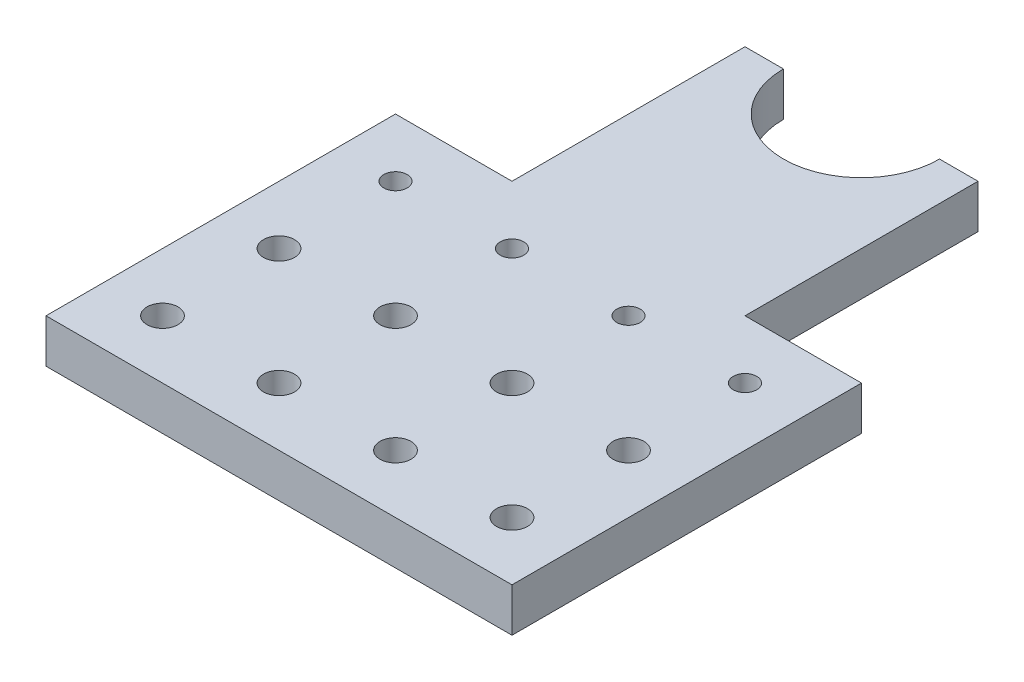
ISO-10303-21;
HEADER;
FILE_DESCRIPTION(('STEP AP214'),'2;1');
FILE_NAME('part.step','',(''),(''),'','','');
FILE_SCHEMA(('AUTOMOTIVE_DESIGN { 1 0 10303 214 1 1 1 1 }'));
ENDSEC;
DATA;
#1=APPLICATION_CONTEXT('core data for automotive mechanical design processes');
#2=APPLICATION_PROTOCOL_DEFINITION('international standard','automotive_design',2000,#1);
#3=PRODUCT_CONTEXT('',#1,'mechanical');
#4=PRODUCT('Part','Part','',(#3));
#5=PRODUCT_RELATED_PRODUCT_CATEGORY('part','',(#4));
#6=PRODUCT_DEFINITION_FORMATION('','',#4);
#7=PRODUCT_DEFINITION_CONTEXT('part definition',#1,'design');
#8=PRODUCT_DEFINITION('design','',#6,#7);
#9=PRODUCT_DEFINITION_SHAPE('','',#8);
#10=(LENGTH_UNIT() NAMED_UNIT(*) SI_UNIT(.MILLI.,.METRE.));
#11=(NAMED_UNIT(*) PLANE_ANGLE_UNIT() SI_UNIT($,.RADIAN.));
#12=(NAMED_UNIT(*) SI_UNIT($,.STERADIAN.) SOLID_ANGLE_UNIT());
#13=UNCERTAINTY_MEASURE_WITH_UNIT(LENGTH_MEASURE(1.E-05),#10,'distance_accuracy_value','');
#14=(GEOMETRIC_REPRESENTATION_CONTEXT(3) GLOBAL_UNCERTAINTY_ASSIGNED_CONTEXT((#13)) GLOBAL_UNIT_ASSIGNED_CONTEXT((#10,
#11,#12)) REPRESENTATION_CONTEXT('',''));
#15=CARTESIAN_POINT('',(0.,0.,0.));
#16=DIRECTION('',(0.,0.,1.));
#17=DIRECTION('',(1.,0.,0.));
#18=AXIS2_PLACEMENT_3D('',#15,#16,#17);
#19=CARTESIAN_POINT('',(0.,9.525,-127.));
#20=DIRECTION('',(0.,0.,1.));
#21=DIRECTION('',(1.,0.,0.));
#22=AXIS2_PLACEMENT_3D('',#19,#20,#21);
#23=PLANE('',#22);
#24=CARTESIAN_POINT('',(71.9455,4.7625,-127.));
#25=DIRECTION('',(0.,0.,-1.));
#26=DIRECTION('',(-1.,0.,0.));
#27=AXIS2_PLACEMENT_3D('',#24,#25,#26);
#28=CIRCLE('',#27,1.7272);
#29=CARTESIAN_POINT('',(70.2183,4.7625,-127.));
#30=VERTEX_POINT('',#29);
#31=EDGE_CURVE('E137',#30,#30,#28,.T.);
#32=ORIENTED_EDGE('',*,*,#31,.F.);
#33=EDGE_LOOP('',(#32));
#34=FACE_BOUND('',#33,.T.);
#35=DIRECTION('',(-1.,0.,0.));
#36=VECTOR('',#35,1.);
#37=CARTESIAN_POINT('',(0.,9.525,-127.));
#38=LINE('',#37,#36);
#39=CARTESIAN_POINT('',(76.2,9.525,-127.));
#40=VERTEX_POINT('',#39);
#41=CARTESIAN_POINT('',(67.818,9.525,-127.));
#42=VERTEX_POINT('',#41);
#43=EDGE_CURVE('E222',#40,#42,#38,.T.);
#44=ORIENTED_EDGE('',*,*,#43,.F.);
#45=DIRECTION('',(0.,1.,0.));
#46=VECTOR('',#45,1.);
#47=CARTESIAN_POINT('',(76.2,0.,-127.));
#48=LINE('',#47,#46);
#49=CARTESIAN_POINT('',(76.2,0.,-127.));
#50=VERTEX_POINT('',#49);
#51=EDGE_CURVE('E153',#50,#40,#48,.T.);
#52=ORIENTED_EDGE('',*,*,#51,.F.);
#53=DIRECTION('',(-1.,0.,0.));
#54=VECTOR('',#53,1.);
#55=CARTESIAN_POINT('',(0.,0.,-127.));
#56=LINE('',#55,#54);
#57=CARTESIAN_POINT('',(67.818,0.,-127.));
#58=VERTEX_POINT('',#57);
#59=EDGE_CURVE('E216',#50,#58,#56,.T.);
#60=ORIENTED_EDGE('',*,*,#59,.T.);
#61=DIRECTION('',(0.,1.,0.));
#62=VECTOR('',#61,1.);
#63=CARTESIAN_POINT('',(67.818,0.,-127.));
#64=LINE('',#63,#62);
#65=EDGE_CURVE('E209',#58,#42,#64,.T.);
#66=ORIENTED_EDGE('',*,*,#65,.T.);
#67=EDGE_LOOP('',(#44,#52,#60,#66));
#68=FACE_BOUND('',#67,.T.);
#69=ADVANCED_FACE('F45',(#34,#68),#23,.F.);
#70=CARTESIAN_POINT('',(0.,9.525,0.));
#71=DIRECTION('',(1.,0.,0.));
#72=DIRECTION('',(0.,0.,-1.));
#73=AXIS2_PLACEMENT_3D('',#70,#71,#72);
#74=PLANE('',#73);
#75=DIRECTION('',(0.,0.,1.));
#76=VECTOR('',#75,1.);
#77=CARTESIAN_POINT('',(0.,9.525,0.));
#78=LINE('',#77,#76);
#79=CARTESIAN_POINT('',(0.,9.525,-76.2));
#80=VERTEX_POINT('',#79);
#81=CARTESIAN_POINT('',(0.,9.525,0.));
#82=VERTEX_POINT('',#81);
#83=EDGE_CURVE('E213',#80,#82,#78,.T.);
#84=ORIENTED_EDGE('',*,*,#83,.F.);
#85=DIRECTION('',(0.,1.,0.));
#86=VECTOR('',#85,1.);
#87=CARTESIAN_POINT('',(0.,0.,-76.2));
#88=LINE('',#87,#86);
#89=CARTESIAN_POINT('',(0.,0.,-76.2));
#90=VERTEX_POINT('',#89);
#91=EDGE_CURVE('E169',#90,#80,#88,.T.);
#92=ORIENTED_EDGE('',*,*,#91,.F.);
#93=DIRECTION('',(0.,0.,1.));
#94=VECTOR('',#93,1.);
#95=CARTESIAN_POINT('',(0.,0.,0.));
#96=LINE('',#95,#94);
#97=CARTESIAN_POINT('',(0.,0.,0.));
#98=VERTEX_POINT('',#97);
#99=EDGE_CURVE('E212',#90,#98,#96,.T.);
#100=ORIENTED_EDGE('',*,*,#99,.T.);
#101=DIRECTION('',(0.,-1.,0.));
#102=VECTOR('',#101,1.);
#103=CARTESIAN_POINT('',(0.,9.525,0.));
#104=LINE('',#103,#102);
#105=EDGE_CURVE('E235',#82,#98,#104,.T.);
#106=ORIENTED_EDGE('',*,*,#105,.F.);
#107=EDGE_LOOP('',(#84,#92,#100,#106));
#108=FACE_BOUND('',#107,.T.);
#109=ADVANCED_FACE('F311',(#108),#74,.F.);
#110=CARTESIAN_POINT('',(0.,9.525,0.));
#111=DIRECTION('',(0.,0.,-1.));
#112=DIRECTION('',(-1.,0.,0.));
#113=AXIS2_PLACEMENT_3D('',#110,#111,#112);
#114=PLANE('',#113);
#115=DIRECTION('',(1.,0.,0.));
#116=VECTOR('',#115,1.);
#117=CARTESIAN_POINT('',(0.,0.,0.));
#118=LINE('',#117,#116);
#119=CARTESIAN_POINT('',(101.6,0.,0.));
#120=VERTEX_POINT('',#119);
#121=EDGE_CURVE('E226',#98,#120,#118,.T.);
#122=ORIENTED_EDGE('',*,*,#121,.T.);
#123=DIRECTION('',(0.,-1.,0.));
#124=VECTOR('',#123,1.);
#125=CARTESIAN_POINT('',(101.6,9.525,0.));
#126=LINE('',#125,#124);
#127=CARTESIAN_POINT('',(101.6,9.525,0.));
#128=VERTEX_POINT('',#127);
#129=EDGE_CURVE('E224',#128,#120,#126,.T.);
#130=ORIENTED_EDGE('',*,*,#129,.F.);
#131=DIRECTION('',(1.,0.,0.));
#132=VECTOR('',#131,1.);
#133=CARTESIAN_POINT('',(0.,9.525,0.));
#134=LINE('',#133,#132);
#135=EDGE_CURVE('E215',#82,#128,#134,.T.);
#136=ORIENTED_EDGE('',*,*,#135,.F.);
#137=ORIENTED_EDGE('',*,*,#105,.T.);
#138=EDGE_LOOP('',(#122,#130,#136,#137));
#139=FACE_BOUND('',#138,.T.);
#140=ADVANCED_FACE('F316',(#139),#114,.F.);
#141=CARTESIAN_POINT('',(101.6,9.525,0.));
#142=DIRECTION('',(-1.,0.,0.));
#143=DIRECTION('',(0.,0.,1.));
#144=AXIS2_PLACEMENT_3D('',#141,#142,#143);
#145=PLANE('',#144);
#146=DIRECTION('',(0.,0.,-1.));
#147=VECTOR('',#146,1.);
#148=CARTESIAN_POINT('',(101.6,0.,0.));
#149=LINE('',#148,#147);
#150=CARTESIAN_POINT('',(101.6,0.,-76.2));
#151=VERTEX_POINT('',#150);
#152=EDGE_CURVE('E228',#120,#151,#149,.T.);
#153=ORIENTED_EDGE('',*,*,#152,.T.);
#154=DIRECTION('',(0.,1.,0.));
#155=VECTOR('',#154,1.);
#156=CARTESIAN_POINT('',(101.6,0.,-76.2));
#157=LINE('',#156,#155);
#158=CARTESIAN_POINT('',(101.6,9.525,-76.2));
#159=VERTEX_POINT('',#158);
#160=EDGE_CURVE('E157',#151,#159,#157,.T.);
#161=ORIENTED_EDGE('',*,*,#160,.T.);
#162=DIRECTION('',(0.,0.,-1.));
#163=VECTOR('',#162,1.);
#164=CARTESIAN_POINT('',(101.6,9.525,0.));
#165=LINE('',#164,#163);
#166=EDGE_CURVE('E218',#128,#159,#165,.T.);
#167=ORIENTED_EDGE('',*,*,#166,.F.);
#168=ORIENTED_EDGE('',*,*,#129,.T.);
#169=EDGE_LOOP('',(#153,#161,#167,#168));
#170=FACE_BOUND('',#169,.T.);
#171=ADVANCED_FACE('F304',(#170),#145,.F.);
#172=CARTESIAN_POINT('',(29.6545,4.7625,-127.));
#173=DIRECTION('',(0.,0.,-1.));
#174=DIRECTION('',(-1.,0.,0.));
#175=AXIS2_PLACEMENT_3D('',#172,#173,#174);
#176=CIRCLE('',#175,1.7272);
#177=CARTESIAN_POINT('',(27.9273,4.7625,-127.));
#178=VERTEX_POINT('',#177);
#179=EDGE_CURVE('E136',#178,#178,#176,.T.);
#180=ORIENTED_EDGE('',*,*,#179,.F.);
#181=EDGE_LOOP('',(#180));
#182=FACE_BOUND('',#181,.T.);
#183=CARTESIAN_POINT('',(33.782,0.,-127.));
#184=VERTEX_POINT('',#183);
#185=CARTESIAN_POINT('',(25.4,0.,-127.));
#186=VERTEX_POINT('',#185);
#187=EDGE_CURVE('E231',#184,#186,#56,.T.);
#188=ORIENTED_EDGE('',*,*,#187,.T.);
#189=DIRECTION('',(0.,1.,0.));
#190=VECTOR('',#189,1.);
#191=CARTESIAN_POINT('',(25.4,0.,-127.));
#192=LINE('',#191,#190);
#193=CARTESIAN_POINT('',(25.4,9.525,-127.));
#194=VERTEX_POINT('',#193);
#195=EDGE_CURVE('E173',#186,#194,#192,.T.);
#196=ORIENTED_EDGE('',*,*,#195,.T.);
#197=CARTESIAN_POINT('',(33.782,9.525,-127.));
#198=VERTEX_POINT('',#197);
#199=EDGE_CURVE('E221',#198,#194,#38,.T.);
#200=ORIENTED_EDGE('',*,*,#199,.F.);
#201=DIRECTION('',(0.,1.,0.));
#202=VECTOR('',#201,1.);
#203=CARTESIAN_POINT('',(33.782,0.,-127.));
#204=LINE('',#203,#202);
#205=EDGE_CURVE('E206',#198,#184,#204,.F.);
#206=ORIENTED_EDGE('',*,*,#205,.T.);
#207=EDGE_LOOP('',(#188,#196,#200,#206));
#208=FACE_BOUND('',#207,.T.);
#209=ADVANCED_FACE('F294',(#182,#208),#23,.F.);
#210=CARTESIAN_POINT('',(0.,9.525,-127.));
#211=DIRECTION('',(0.,-1.,0.));
#212=DIRECTION('',(0.,0.,-1.));
#213=AXIS2_PLACEMENT_3D('',#210,#211,#212);
#214=PLANE('',#213);
#215=CARTESIAN_POINT('',(38.1,9.525,-63.5));
#216=DIRECTION('',(0.,1.,0.));
#217=DIRECTION('',(0.,0.,1.));
#218=AXIS2_PLACEMENT_3D('',#215,#216,#217);
#219=CIRCLE('',#218,2.55269999999999);
#220=CARTESIAN_POINT('',(38.1,9.525,-60.9473));
#221=VERTEX_POINT('',#220);
#222=EDGE_CURVE('E182',#221,#221,#219,.T.);
#223=ORIENTED_EDGE('',*,*,#222,.F.);
#224=EDGE_LOOP('',(#223));
#225=FACE_BOUND('',#224,.T.);
#226=CARTESIAN_POINT('',(12.7,9.525,-63.5));
#227=DIRECTION('',(0.,1.,0.));
#228=DIRECTION('',(0.,0.,1.));
#229=AXIS2_PLACEMENT_3D('',#226,#227,#228);
#230=CIRCLE('',#229,2.55269999999999);
#231=CARTESIAN_POINT('',(12.7,9.525,-60.9473));
#232=VERTEX_POINT('',#231);
#233=EDGE_CURVE('E185',#232,#232,#230,.T.);
#234=ORIENTED_EDGE('',*,*,#233,.F.);
#235=EDGE_LOOP('',(#234));
#236=FACE_BOUND('',#235,.T.);
#237=CARTESIAN_POINT('',(12.7,9.525,-38.1));
#238=DIRECTION('',(0.,1.,0.));
#239=DIRECTION('',(0.,0.,1.));
#240=AXIS2_PLACEMENT_3D('',#237,#238,#239);
#241=CIRCLE('',#240,3.37819999999999);
#242=CARTESIAN_POINT('',(12.7,9.525,-34.7218));
#243=VERTEX_POINT('',#242);
#244=EDGE_CURVE('E194',#243,#243,#241,.T.);
#245=ORIENTED_EDGE('',*,*,#244,.F.);
#246=EDGE_LOOP('',(#245));
#247=FACE_BOUND('',#246,.T.);
#248=CARTESIAN_POINT('',(12.7,9.525,-12.7));
#249=DIRECTION('',(0.,1.,0.));
#250=DIRECTION('',(0.,0.,1.));
#251=AXIS2_PLACEMENT_3D('',#248,#249,#250);
#252=CIRCLE('',#251,3.37819999999999);
#253=CARTESIAN_POINT('',(12.7,9.525,-9.32180000000001));
#254=VERTEX_POINT('',#253);
#255=EDGE_CURVE('E197',#254,#254,#252,.T.);
#256=ORIENTED_EDGE('',*,*,#255,.F.);
#257=EDGE_LOOP('',(#256));
#258=FACE_BOUND('',#257,.T.);
#259=ORIENTED_EDGE('',*,*,#166,.T.);
#260=DIRECTION('',(1.,0.,0.));
#261=VECTOR('',#260,1.);
#262=CARTESIAN_POINT('',(101.6,9.525,-76.2));
#263=LINE('',#262,#261);
#264=CARTESIAN_POINT('',(76.2,9.525,-76.2));
#265=VERTEX_POINT('',#264);
#266=EDGE_CURVE('E151',#265,#159,#263,.T.);
#267=ORIENTED_EDGE('',*,*,#266,.F.);
#268=DIRECTION('',(0.,0.,1.));
#269=VECTOR('',#268,1.);
#270=CARTESIAN_POINT('',(76.2,9.525,-127.));
#271=LINE('',#270,#269);
#272=EDGE_CURVE('E147',#40,#265,#271,.T.);
#273=ORIENTED_EDGE('',*,*,#272,.F.);
#274=ORIENTED_EDGE('',*,*,#43,.T.);
#275=CARTESIAN_POINT('',(50.8,9.525,-127.));
#276=DIRECTION('',(0.,1.,0.));
#277=DIRECTION('',(0.,0.,1.));
#278=AXIS2_PLACEMENT_3D('',#275,#276,#277);
#279=CIRCLE('',#278,17.018);
#280=EDGE_CURVE('E203',#198,#42,#279,.T.);
#281=ORIENTED_EDGE('',*,*,#280,.F.);
#282=ORIENTED_EDGE('',*,*,#199,.T.);
#283=DIRECTION('',(0.,0.,-1.));
#284=VECTOR('',#283,1.);
#285=CARTESIAN_POINT('',(25.4,9.525,-127.));
#286=LINE('',#285,#284);
#287=CARTESIAN_POINT('',(25.4,9.525,-76.2));
#288=VERTEX_POINT('',#287);
#289=EDGE_CURVE('E167',#288,#194,#286,.T.);
#290=ORIENTED_EDGE('',*,*,#289,.F.);
#291=DIRECTION('',(1.,0.,0.));
#292=VECTOR('',#291,1.);
#293=CARTESIAN_POINT('',(0.,9.525,-76.2));
#294=LINE('',#293,#292);
#295=EDGE_CURVE('E160',#80,#288,#294,.T.);
#296=ORIENTED_EDGE('',*,*,#295,.F.);
#297=ORIENTED_EDGE('',*,*,#83,.T.);
#298=ORIENTED_EDGE('',*,*,#135,.T.);
#299=EDGE_LOOP('',(#259,#267,#273,#274,#281,#282,#290,#296,#297,#298));
#300=FACE_BOUND('',#299,.T.);
#301=CARTESIAN_POINT('',(38.1,9.525,-12.7));
#302=DIRECTION('',(0.,1.,0.));
#303=DIRECTION('',(0.,0.,1.));
#304=AXIS2_PLACEMENT_3D('',#301,#302,#303);
#305=CIRCLE('',#304,3.37819999999999);
#306=CARTESIAN_POINT('',(38.1,9.525,-9.32180000000001));
#307=VERTEX_POINT('',#306);
#308=EDGE_CURVE('E243',#307,#307,#305,.T.);
#309=ORIENTED_EDGE('',*,*,#308,.F.);
#310=EDGE_LOOP('',(#309));
#311=FACE_BOUND('',#310,.T.);
#312=CARTESIAN_POINT('',(38.1,9.525,-38.1));
#313=DIRECTION('',(0.,1.,0.));
#314=DIRECTION('',(0.,0.,1.));
#315=AXIS2_PLACEMENT_3D('',#312,#313,#314);
#316=CIRCLE('',#315,3.37819999999999);
#317=CARTESIAN_POINT('',(38.1,9.525,-34.7218));
#318=VERTEX_POINT('',#317);
#319=EDGE_CURVE('E249',#318,#318,#316,.T.);
#320=ORIENTED_EDGE('',*,*,#319,.F.);
#321=EDGE_LOOP('',(#320));
#322=FACE_BOUND('',#321,.T.);
#323=CARTESIAN_POINT('',(63.5,9.525,-12.7));
#324=DIRECTION('',(0.,1.,0.));
#325=DIRECTION('',(0.,0.,1.));
#326=AXIS2_PLACEMENT_3D('',#323,#324,#325);
#327=CIRCLE('',#326,3.37819999999999);
#328=CARTESIAN_POINT('',(63.5,9.525,-9.32180000000001));
#329=VERTEX_POINT('',#328);
#330=EDGE_CURVE('E255',#329,#329,#327,.T.);
#331=ORIENTED_EDGE('',*,*,#330,.F.);
#332=EDGE_LOOP('',(#331));
#333=FACE_BOUND('',#332,.T.);
#334=CARTESIAN_POINT('',(63.5,9.525,-38.1));
#335=DIRECTION('',(0.,1.,0.));
#336=DIRECTION('',(0.,0.,1.));
#337=AXIS2_PLACEMENT_3D('',#334,#335,#336);
#338=CIRCLE('',#337,3.37819999999999);
#339=CARTESIAN_POINT('',(63.5,9.525,-34.7218));
#340=VERTEX_POINT('',#339);
#341=EDGE_CURVE('E261',#340,#340,#338,.T.);
#342=ORIENTED_EDGE('',*,*,#341,.F.);
#343=EDGE_LOOP('',(#342));
#344=FACE_BOUND('',#343,.T.);
#345=CARTESIAN_POINT('',(88.9,9.525,-12.7));
#346=DIRECTION('',(0.,1.,0.));
#347=DIRECTION('',(0.,0.,1.));
#348=AXIS2_PLACEMENT_3D('',#345,#346,#347);
#349=CIRCLE('',#348,3.37819999999999);
#350=CARTESIAN_POINT('',(88.9,9.525,-9.32180000000001));
#351=VERTEX_POINT('',#350);
#352=EDGE_CURVE('E267',#351,#351,#349,.T.);
#353=ORIENTED_EDGE('',*,*,#352,.F.);
#354=EDGE_LOOP('',(#353));
#355=FACE_BOUND('',#354,.T.);
#356=CARTESIAN_POINT('',(88.9,9.525,-38.1));
#357=DIRECTION('',(0.,1.,0.));
#358=DIRECTION('',(0.,0.,1.));
#359=AXIS2_PLACEMENT_3D('',#356,#357,#358);
#360=CIRCLE('',#359,3.37819999999999);
#361=CARTESIAN_POINT('',(88.9,9.525,-34.7218));
#362=VERTEX_POINT('',#361);
#363=EDGE_CURVE('E273',#362,#362,#360,.T.);
#364=ORIENTED_EDGE('',*,*,#363,.F.);
#365=EDGE_LOOP('',(#364));
#366=FACE_BOUND('',#365,.T.);
#367=CARTESIAN_POINT('',(63.5,9.525,-63.5));
#368=DIRECTION('',(0.,1.,0.));
#369=DIRECTION('',(0.,0.,1.));
#370=AXIS2_PLACEMENT_3D('',#367,#368,#369);
#371=CIRCLE('',#370,2.55269999999999);
#372=CARTESIAN_POINT('',(63.5,9.525,-60.9473));
#373=VERTEX_POINT('',#372);
#374=EDGE_CURVE('E279',#373,#373,#371,.T.);
#375=ORIENTED_EDGE('',*,*,#374,.F.);
#376=EDGE_LOOP('',(#375));
#377=FACE_BOUND('',#376,.T.);
#378=CARTESIAN_POINT('',(88.9,9.525,-63.5));
#379=DIRECTION('',(0.,1.,0.));
#380=DIRECTION('',(0.,0.,1.));
#381=AXIS2_PLACEMENT_3D('',#378,#379,#380);
#382=CIRCLE('',#381,2.55269999999999);
#383=CARTESIAN_POINT('',(88.9,9.525,-60.9473));
#384=VERTEX_POINT('',#383);
#385=EDGE_CURVE('E13',#384,#384,#382,.T.);
#386=ORIENTED_EDGE('',*,*,#385,.F.);
#387=EDGE_LOOP('',(#386));
#388=FACE_BOUND('',#387,.T.);
#389=ADVANCED_FACE('F292',(#225,#236,#247,#258,#300,#311,#322,#333,#344,#355,#366,#377,#388),
#214,.F.);
#390=CARTESIAN_POINT('',(0.,0.,-127.));
#391=DIRECTION('',(0.,-1.,0.));
#392=DIRECTION('',(0.,0.,-1.));
#393=AXIS2_PLACEMENT_3D('',#390,#391,#392);
#394=PLANE('',#393);
#395=DIRECTION('',(1.,0.,0.));
#396=VECTOR('',#395,1.);
#397=CARTESIAN_POINT('',(101.6,0.,-76.2));
#398=LINE('',#397,#396);
#399=CARTESIAN_POINT('',(76.2,0.,-76.2));
#400=VERTEX_POINT('',#399);
#401=EDGE_CURVE('E60',#400,#151,#398,.T.);
#402=ORIENTED_EDGE('',*,*,#401,.T.);
#403=ORIENTED_EDGE('',*,*,#152,.F.);
#404=ORIENTED_EDGE('',*,*,#121,.F.);
#405=ORIENTED_EDGE('',*,*,#99,.F.);
#406=DIRECTION('',(1.,0.,0.));
#407=VECTOR('',#406,1.);
#408=CARTESIAN_POINT('',(0.,0.,-76.2));
#409=LINE('',#408,#407);
#410=CARTESIAN_POINT('',(25.4,0.,-76.2));
#411=VERTEX_POINT('',#410);
#412=EDGE_CURVE('E164',#90,#411,#409,.T.);
#413=ORIENTED_EDGE('',*,*,#412,.T.);
#414=DIRECTION('',(0.,0.,-1.));
#415=VECTOR('',#414,1.);
#416=CARTESIAN_POINT('',(25.4,0.,-127.));
#417=LINE('',#416,#415);
#418=EDGE_CURVE('E68',#411,#186,#417,.T.);
#419=ORIENTED_EDGE('',*,*,#418,.T.);
#420=ORIENTED_EDGE('',*,*,#187,.F.);
#421=CARTESIAN_POINT('',(50.8,0.,-127.));
#422=DIRECTION('',(0.,-1.,0.));
#423=DIRECTION('',(0.,0.,-1.));
#424=AXIS2_PLACEMENT_3D('',#421,#422,#423);
#425=CIRCLE('',#424,17.018);
#426=EDGE_CURVE('E238',#58,#184,#425,.T.);
#427=ORIENTED_EDGE('',*,*,#426,.F.);
#428=ORIENTED_EDGE('',*,*,#59,.F.);
#429=DIRECTION('',(0.,0.,1.));
#430=VECTOR('',#429,1.);
#431=CARTESIAN_POINT('',(76.2,0.,-127.));
#432=LINE('',#431,#430);
#433=EDGE_CURVE('E148',#50,#400,#432,.T.);
#434=ORIENTED_EDGE('',*,*,#433,.T.);
#435=EDGE_LOOP('',(#402,#403,#404,#405,#413,#419,#420,#427,#428,#434));
#436=FACE_BOUND('',#435,.T.);
#437=CARTESIAN_POINT('',(38.1,0.,-63.5));
#438=DIRECTION('',(0.,1.,0.));
#439=DIRECTION('',(0.,0.,1.));
#440=AXIS2_PLACEMENT_3D('',#437,#438,#439);
#441=CIRCLE('',#440,2.5527);
#442=CARTESIAN_POINT('',(38.1,0.,-60.9473));
#443=VERTEX_POINT('',#442);
#444=EDGE_CURVE('E176',#443,#443,#441,.T.);
#445=ORIENTED_EDGE('',*,*,#444,.T.);
#446=EDGE_LOOP('',(#445));
#447=FACE_BOUND('',#446,.T.);
#448=CARTESIAN_POINT('',(12.7,0.,-63.5));
#449=DIRECTION('',(0.,1.,0.));
#450=DIRECTION('',(0.,0.,1.));
#451=AXIS2_PLACEMENT_3D('',#448,#449,#450);
#452=CIRCLE('',#451,2.5527);
#453=CARTESIAN_POINT('',(12.7,0.,-60.9473));
#454=VERTEX_POINT('',#453);
#455=EDGE_CURVE('E188',#454,#454,#452,.T.);
#456=ORIENTED_EDGE('',*,*,#455,.T.);
#457=EDGE_LOOP('',(#456));
#458=FACE_BOUND('',#457,.T.);
#459=CARTESIAN_POINT('',(12.7,0.,-38.1));
#460=DIRECTION('',(0.,1.,0.));
#461=DIRECTION('',(0.,0.,1.));
#462=AXIS2_PLACEMENT_3D('',#459,#460,#461);
#463=CIRCLE('',#462,3.3782);
#464=CARTESIAN_POINT('',(12.7,0.,-34.7218));
#465=VERTEX_POINT('',#464);
#466=EDGE_CURVE('E191',#465,#465,#463,.T.);
#467=ORIENTED_EDGE('',*,*,#466,.T.);
#468=EDGE_LOOP('',(#467));
#469=FACE_BOUND('',#468,.T.);
#470=CARTESIAN_POINT('',(12.7,0.,-12.7));
#471=DIRECTION('',(0.,1.,0.));
#472=DIRECTION('',(0.,0.,1.));
#473=AXIS2_PLACEMENT_3D('',#470,#471,#472);
#474=CIRCLE('',#473,3.3782);
#475=CARTESIAN_POINT('',(12.7,0.,-9.3218));
#476=VERTEX_POINT('',#475);
#477=EDGE_CURVE('E200',#476,#476,#474,.T.);
#478=ORIENTED_EDGE('',*,*,#477,.T.);
#479=EDGE_LOOP('',(#478));
#480=FACE_BOUND('',#479,.T.);
#481=CARTESIAN_POINT('',(38.1,0.,-12.7));
#482=DIRECTION('',(0.,1.,0.));
#483=DIRECTION('',(0.,0.,1.));
#484=AXIS2_PLACEMENT_3D('',#481,#482,#483);
#485=CIRCLE('',#484,3.3782);
#486=CARTESIAN_POINT('',(38.1,0.,-9.3218));
#487=VERTEX_POINT('',#486);
#488=EDGE_CURVE('E240',#487,#487,#485,.T.);
#489=ORIENTED_EDGE('',*,*,#488,.T.);
#490=EDGE_LOOP('',(#489));
#491=FACE_BOUND('',#490,.T.);
#492=CARTESIAN_POINT('',(38.1,0.,-38.1));
#493=DIRECTION('',(0.,1.,0.));
#494=DIRECTION('',(0.,0.,1.));
#495=AXIS2_PLACEMENT_3D('',#492,#493,#494);
#496=CIRCLE('',#495,3.3782);
#497=CARTESIAN_POINT('',(38.1,0.,-34.7218));
#498=VERTEX_POINT('',#497);
#499=EDGE_CURVE('E246',#498,#498,#496,.T.);
#500=ORIENTED_EDGE('',*,*,#499,.T.);
#501=EDGE_LOOP('',(#500));
#502=FACE_BOUND('',#501,.T.);
#503=CARTESIAN_POINT('',(63.5,0.,-12.7));
#504=DIRECTION('',(0.,1.,0.));
#505=DIRECTION('',(0.,0.,1.));
#506=AXIS2_PLACEMENT_3D('',#503,#504,#505);
#507=CIRCLE('',#506,3.3782);
#508=CARTESIAN_POINT('',(63.5,0.,-9.3218));
#509=VERTEX_POINT('',#508);
#510=EDGE_CURVE('E252',#509,#509,#507,.T.);
#511=ORIENTED_EDGE('',*,*,#510,.T.);
#512=EDGE_LOOP('',(#511));
#513=FACE_BOUND('',#512,.T.);
#514=CARTESIAN_POINT('',(63.5,0.,-38.1));
#515=DIRECTION('',(0.,1.,0.));
#516=DIRECTION('',(0.,0.,1.));
#517=AXIS2_PLACEMENT_3D('',#514,#515,#516);
#518=CIRCLE('',#517,3.3782);
#519=CARTESIAN_POINT('',(63.5,0.,-34.7218));
#520=VERTEX_POINT('',#519);
#521=EDGE_CURVE('E258',#520,#520,#518,.T.);
#522=ORIENTED_EDGE('',*,*,#521,.T.);
#523=EDGE_LOOP('',(#522));
#524=FACE_BOUND('',#523,.T.);
#525=CARTESIAN_POINT('',(88.9,0.,-12.7));
#526=DIRECTION('',(0.,1.,0.));
#527=DIRECTION('',(0.,0.,1.));
#528=AXIS2_PLACEMENT_3D('',#525,#526,#527);
#529=CIRCLE('',#528,3.3782);
#530=CARTESIAN_POINT('',(88.9,0.,-9.3218));
#531=VERTEX_POINT('',#530);
#532=EDGE_CURVE('E264',#531,#531,#529,.T.);
#533=ORIENTED_EDGE('',*,*,#532,.T.);
#534=EDGE_LOOP('',(#533));
#535=FACE_BOUND('',#534,.T.);
#536=CARTESIAN_POINT('',(88.9,0.,-38.1));
#537=DIRECTION('',(0.,1.,0.));
#538=DIRECTION('',(0.,0.,1.));
#539=AXIS2_PLACEMENT_3D('',#536,#537,#538);
#540=CIRCLE('',#539,3.3782);
#541=CARTESIAN_POINT('',(88.9,0.,-34.7218));
#542=VERTEX_POINT('',#541);
#543=EDGE_CURVE('E270',#542,#542,#540,.T.);
#544=ORIENTED_EDGE('',*,*,#543,.T.);
#545=EDGE_LOOP('',(#544));
#546=FACE_BOUND('',#545,.T.);
#547=CARTESIAN_POINT('',(63.5,0.,-63.5));
#548=DIRECTION('',(0.,1.,0.));
#549=DIRECTION('',(0.,0.,1.));
#550=AXIS2_PLACEMENT_3D('',#547,#548,#549);
#551=CIRCLE('',#550,2.5527);
#552=CARTESIAN_POINT('',(63.5,0.,-60.9473));
#553=VERTEX_POINT('',#552);
#554=EDGE_CURVE('E276',#553,#553,#551,.T.);
#555=ORIENTED_EDGE('',*,*,#554,.T.);
#556=EDGE_LOOP('',(#555));
#557=FACE_BOUND('',#556,.T.);
#558=CARTESIAN_POINT('',(88.9,0.,-63.5));
#559=DIRECTION('',(0.,1.,0.));
#560=DIRECTION('',(0.,0.,1.));
#561=AXIS2_PLACEMENT_3D('',#558,#559,#560);
#562=CIRCLE('',#561,2.5527);
#563=CARTESIAN_POINT('',(88.9,0.,-60.9473));
#564=VERTEX_POINT('',#563);
#565=EDGE_CURVE('E53',#564,#564,#562,.T.);
#566=ORIENTED_EDGE('',*,*,#565,.T.);
#567=EDGE_LOOP('',(#566));
#568=FACE_BOUND('',#567,.T.);
#569=ADVANCED_FACE('F284',(#436,#447,#458,#469,#480,#491,#502,#513,#524,#535,#546,#557,#568),
#394,.T.);
#570=CARTESIAN_POINT('',(50.8,0.,-127.));
#571=DIRECTION('',(0.,1.,0.));
#572=DIRECTION('',(0.,0.,1.));
#573=AXIS2_PLACEMENT_3D('',#570,#571,#572);
#574=CYLINDRICAL_SURFACE('',#573,17.018);
#575=ORIENTED_EDGE('',*,*,#426,.T.);
#576=ORIENTED_EDGE('',*,*,#205,.F.);
#577=ORIENTED_EDGE('',*,*,#280,.T.);
#578=ORIENTED_EDGE('',*,*,#65,.F.);
#579=EDGE_LOOP('',(#575,#576,#577,#578));
#580=FACE_BOUND('',#579,.T.);
#581=ADVANCED_FACE('F301',(#580),#574,.F.);
#582=CARTESIAN_POINT('',(12.7,9.525,-12.7));
#583=DIRECTION('',(0.,1.,0.));
#584=DIRECTION('',(0.,0.,1.));
#585=AXIS2_PLACEMENT_3D('',#582,#583,#584);
#586=CYLINDRICAL_SURFACE('',#585,3.37819999999999);
#587=ORIENTED_EDGE('',*,*,#477,.F.);
#588=EDGE_LOOP('',(#587));
#589=FACE_BOUND('',#588,.T.);
#590=ORIENTED_EDGE('',*,*,#255,.T.);
#591=EDGE_LOOP('',(#590));
#592=FACE_BOUND('',#591,.T.);
#593=ADVANCED_FACE('F379',(#589,#592),#586,.F.);
#594=CARTESIAN_POINT('',(12.7,9.525,-38.1));
#595=DIRECTION('',(0.,1.,0.));
#596=DIRECTION('',(0.,0.,1.));
#597=AXIS2_PLACEMENT_3D('',#594,#595,#596);
#598=CYLINDRICAL_SURFACE('',#597,3.37819999999999);
#599=ORIENTED_EDGE('',*,*,#466,.F.);
#600=EDGE_LOOP('',(#599));
#601=FACE_BOUND('',#600,.T.);
#602=ORIENTED_EDGE('',*,*,#244,.T.);
#603=EDGE_LOOP('',(#602));
#604=FACE_BOUND('',#603,.T.);
#605=ADVANCED_FACE('F332',(#601,#604),#598,.F.);
#606=CARTESIAN_POINT('',(38.1,9.525,-12.7));
#607=DIRECTION('',(0.,1.,0.));
#608=DIRECTION('',(0.,0.,1.));
#609=AXIS2_PLACEMENT_3D('',#606,#607,#608);
#610=CYLINDRICAL_SURFACE('',#609,3.37819999999999);
#611=ORIENTED_EDGE('',*,*,#488,.F.);
#612=EDGE_LOOP('',(#611));
#613=FACE_BOUND('',#612,.T.);
#614=ORIENTED_EDGE('',*,*,#308,.T.);
#615=EDGE_LOOP('',(#614));
#616=FACE_BOUND('',#615,.T.);
#617=ADVANCED_FACE('F328',(#613,#616),#610,.F.);
#618=CARTESIAN_POINT('',(38.1,9.525,-38.1));
#619=DIRECTION('',(0.,1.,0.));
#620=DIRECTION('',(0.,0.,1.));
#621=AXIS2_PLACEMENT_3D('',#618,#619,#620);
#622=CYLINDRICAL_SURFACE('',#621,3.37819999999999);
#623=ORIENTED_EDGE('',*,*,#499,.F.);
#624=EDGE_LOOP('',(#623));
#625=FACE_BOUND('',#624,.T.);
#626=ORIENTED_EDGE('',*,*,#319,.T.);
#627=EDGE_LOOP('',(#626));
#628=FACE_BOUND('',#627,.T.);
#629=ADVANCED_FACE('F331',(#625,#628),#622,.F.);
#630=CARTESIAN_POINT('',(63.5,9.525,-12.7));
#631=DIRECTION('',(0.,1.,0.));
#632=DIRECTION('',(0.,0.,1.));
#633=AXIS2_PLACEMENT_3D('',#630,#631,#632);
#634=CYLINDRICAL_SURFACE('',#633,3.37819999999999);
#635=ORIENTED_EDGE('',*,*,#510,.F.);
#636=EDGE_LOOP('',(#635));
#637=FACE_BOUND('',#636,.T.);
#638=ORIENTED_EDGE('',*,*,#330,.T.);
#639=EDGE_LOOP('',(#638));
#640=FACE_BOUND('',#639,.T.);
#641=ADVANCED_FACE('F336',(#637,#640),#634,.F.);
#642=CARTESIAN_POINT('',(63.5,9.525,-38.1));
#643=DIRECTION('',(0.,1.,0.));
#644=DIRECTION('',(0.,0.,1.));
#645=AXIS2_PLACEMENT_3D('',#642,#643,#644);
#646=CYLINDRICAL_SURFACE('',#645,3.37819999999999);
#647=ORIENTED_EDGE('',*,*,#521,.F.);
#648=EDGE_LOOP('',(#647));
#649=FACE_BOUND('',#648,.T.);
#650=ORIENTED_EDGE('',*,*,#341,.T.);
#651=EDGE_LOOP('',(#650));
#652=FACE_BOUND('',#651,.T.);
#653=ADVANCED_FACE('F340',(#649,#652),#646,.F.);
#654=CARTESIAN_POINT('',(88.9,9.525,-12.7));
#655=DIRECTION('',(0.,1.,0.));
#656=DIRECTION('',(0.,0.,1.));
#657=AXIS2_PLACEMENT_3D('',#654,#655,#656);
#658=CYLINDRICAL_SURFACE('',#657,3.37819999999999);
#659=ORIENTED_EDGE('',*,*,#532,.F.);
#660=EDGE_LOOP('',(#659));
#661=FACE_BOUND('',#660,.T.);
#662=ORIENTED_EDGE('',*,*,#352,.T.);
#663=EDGE_LOOP('',(#662));
#664=FACE_BOUND('',#663,.T.);
#665=ADVANCED_FACE('F344',(#661,#664),#658,.F.);
#666=CARTESIAN_POINT('',(88.9,9.525,-38.1));
#667=DIRECTION('',(0.,1.,0.));
#668=DIRECTION('',(0.,0.,1.));
#669=AXIS2_PLACEMENT_3D('',#666,#667,#668);
#670=CYLINDRICAL_SURFACE('',#669,3.37819999999999);
#671=ORIENTED_EDGE('',*,*,#543,.F.);
#672=EDGE_LOOP('',(#671));
#673=FACE_BOUND('',#672,.T.);
#674=ORIENTED_EDGE('',*,*,#363,.T.);
#675=EDGE_LOOP('',(#674));
#676=FACE_BOUND('',#675,.T.);
#677=ADVANCED_FACE('F348',(#673,#676),#670,.F.);
#678=CARTESIAN_POINT('',(12.7,9.525,-63.5));
#679=DIRECTION('',(0.,1.,0.));
#680=DIRECTION('',(0.,0.,1.));
#681=AXIS2_PLACEMENT_3D('',#678,#679,#680);
#682=CYLINDRICAL_SURFACE('',#681,2.55269999999999);
#683=ORIENTED_EDGE('',*,*,#455,.F.);
#684=EDGE_LOOP('',(#683));
#685=FACE_BOUND('',#684,.T.);
#686=ORIENTED_EDGE('',*,*,#233,.T.);
#687=EDGE_LOOP('',(#686));
#688=FACE_BOUND('',#687,.T.);
#689=ADVANCED_FACE('F351',(#685,#688),#682,.F.);
#690=CARTESIAN_POINT('',(38.1,9.525,-63.5));
#691=DIRECTION('',(0.,1.,0.));
#692=DIRECTION('',(0.,0.,1.));
#693=AXIS2_PLACEMENT_3D('',#690,#691,#692);
#694=CYLINDRICAL_SURFACE('',#693,2.55269999999999);
#695=ORIENTED_EDGE('',*,*,#444,.F.);
#696=EDGE_LOOP('',(#695));
#697=FACE_BOUND('',#696,.T.);
#698=ORIENTED_EDGE('',*,*,#222,.T.);
#699=EDGE_LOOP('',(#698));
#700=FACE_BOUND('',#699,.T.);
#701=ADVANCED_FACE('F354',(#697,#700),#694,.F.);
#702=CARTESIAN_POINT('',(63.5,9.525,-63.5));
#703=DIRECTION('',(0.,1.,0.));
#704=DIRECTION('',(0.,0.,1.));
#705=AXIS2_PLACEMENT_3D('',#702,#703,#704);
#706=CYLINDRICAL_SURFACE('',#705,2.55269999999999);
#707=ORIENTED_EDGE('',*,*,#554,.F.);
#708=EDGE_LOOP('',(#707));
#709=FACE_BOUND('',#708,.T.);
#710=ORIENTED_EDGE('',*,*,#374,.T.);
#711=EDGE_LOOP('',(#710));
#712=FACE_BOUND('',#711,.T.);
#713=ADVANCED_FACE('F289',(#709,#712),#706,.F.);
#714=CARTESIAN_POINT('',(88.9,9.525,-63.5));
#715=DIRECTION('',(0.,1.,0.));
#716=DIRECTION('',(0.,0.,1.));
#717=AXIS2_PLACEMENT_3D('',#714,#715,#716);
#718=CYLINDRICAL_SURFACE('',#717,2.55269999999999);
#719=ORIENTED_EDGE('',*,*,#565,.F.);
#720=EDGE_LOOP('',(#719));
#721=FACE_BOUND('',#720,.T.);
#722=ORIENTED_EDGE('',*,*,#385,.T.);
#723=EDGE_LOOP('',(#722));
#724=FACE_BOUND('',#723,.T.);
#725=ADVANCED_FACE('F47',(#721,#724),#718,.F.);
#726=CARTESIAN_POINT('',(25.4,0.,-127.));
#727=DIRECTION('',(1.,0.,0.));
#728=DIRECTION('',(0.,0.,-1.));
#729=AXIS2_PLACEMENT_3D('',#726,#727,#728);
#730=PLANE('',#729);
#731=ORIENTED_EDGE('',*,*,#289,.T.);
#732=ORIENTED_EDGE('',*,*,#195,.F.);
#733=ORIENTED_EDGE('',*,*,#418,.F.);
#734=DIRECTION('',(0.,1.,0.));
#735=VECTOR('',#734,1.);
#736=CARTESIAN_POINT('',(25.4,0.,-76.2));
#737=LINE('',#736,#735);
#738=EDGE_CURVE('E177',#411,#288,#737,.T.);
#739=ORIENTED_EDGE('',*,*,#738,.T.);
#740=EDGE_LOOP('',(#731,#732,#733,#739));
#741=FACE_BOUND('',#740,.T.);
#742=ADVANCED_FACE('F288',(#741),#730,.F.);
#743=CARTESIAN_POINT('',(0.,0.,-76.2));
#744=DIRECTION('',(0.,0.,1.));
#745=DIRECTION('',(1.,0.,0.));
#746=AXIS2_PLACEMENT_3D('',#743,#744,#745);
#747=PLANE('',#746);
#748=ORIENTED_EDGE('',*,*,#295,.T.);
#749=ORIENTED_EDGE('',*,*,#738,.F.);
#750=ORIENTED_EDGE('',*,*,#412,.F.);
#751=ORIENTED_EDGE('',*,*,#91,.T.);
#752=EDGE_LOOP('',(#748,#749,#750,#751));
#753=FACE_BOUND('',#752,.T.);
#754=ADVANCED_FACE('F374',(#753),#747,.F.);
#755=CARTESIAN_POINT('',(101.6,0.,-76.2));
#756=DIRECTION('',(0.,0.,1.));
#757=DIRECTION('',(1.,0.,0.));
#758=AXIS2_PLACEMENT_3D('',#755,#756,#757);
#759=PLANE('',#758);
#760=ORIENTED_EDGE('',*,*,#266,.T.);
#761=ORIENTED_EDGE('',*,*,#160,.F.);
#762=ORIENTED_EDGE('',*,*,#401,.F.);
#763=DIRECTION('',(0.,1.,0.));
#764=VECTOR('',#763,1.);
#765=CARTESIAN_POINT('',(76.2,0.,-76.2));
#766=LINE('',#765,#764);
#767=EDGE_CURVE('E161',#400,#265,#766,.T.);
#768=ORIENTED_EDGE('',*,*,#767,.T.);
#769=EDGE_LOOP('',(#760,#761,#762,#768));
#770=FACE_BOUND('',#769,.T.);
#771=ADVANCED_FACE('F414',(#770),#759,.F.);
#772=CARTESIAN_POINT('',(76.2,0.,-127.));
#773=DIRECTION('',(-1.,0.,0.));
#774=DIRECTION('',(0.,0.,1.));
#775=AXIS2_PLACEMENT_3D('',#772,#773,#774);
#776=PLANE('',#775);
#777=ORIENTED_EDGE('',*,*,#272,.T.);
#778=ORIENTED_EDGE('',*,*,#767,.F.);
#779=ORIENTED_EDGE('',*,*,#433,.F.);
#780=ORIENTED_EDGE('',*,*,#51,.T.);
#781=EDGE_LOOP('',(#777,#778,#779,#780));
#782=FACE_BOUND('',#781,.T.);
#783=ADVANCED_FACE('F416',(#782),#776,.F.);
#784=CARTESIAN_POINT('',(29.6545,4.7625,-116.332));
#785=DIRECTION('',(0.,0.,-1.));
#786=DIRECTION('',(-1.,0.,0.));
#787=AXIS2_PLACEMENT_3D('',#784,#785,#786);
#788=CONICAL_SURFACE('',#787,1.7272,1.02974425867665);
#789=CARTESIAN_POINT('',(29.6545,4.7625,-115.294193538816));
#790=VERTEX_POINT('',#789);
#791=VERTEX_LOOP('',#790);
#792=FACE_BOUND('',#791,.T.);
#793=CARTESIAN_POINT('',(29.6545,4.7625,-116.332));
#794=DIRECTION('',(0.,0.,-1.));
#795=DIRECTION('',(-1.,0.,0.));
#796=AXIS2_PLACEMENT_3D('',#793,#794,#795);
#797=CIRCLE('',#796,1.7272);
#798=CARTESIAN_POINT('',(27.9273,4.7625,-116.332));
#799=VERTEX_POINT('',#798);
#800=EDGE_CURVE('E140',#799,#799,#797,.T.);
#801=ORIENTED_EDGE('',*,*,#800,.T.);
#802=EDGE_LOOP('',(#801));
#803=FACE_BOUND('',#802,.T.);
#804=ADVANCED_FACE('F425',(#792,#803),#788,.F.);
#805=CARTESIAN_POINT('',(29.6545,4.7625,-127.));
#806=DIRECTION('',(0.,0.,-1.));
#807=DIRECTION('',(-1.,0.,0.));
#808=AXIS2_PLACEMENT_3D('',#805,#806,#807);
#809=CYLINDRICAL_SURFACE('',#808,1.7272);
#810=ORIENTED_EDGE('',*,*,#800,.F.);
#811=EDGE_LOOP('',(#810));
#812=FACE_BOUND('',#811,.T.);
#813=ORIENTED_EDGE('',*,*,#179,.T.);
#814=EDGE_LOOP('',(#813));
#815=FACE_BOUND('',#814,.T.);
#816=ADVANCED_FACE('F130',(#812,#815),#809,.F.);
#817=CARTESIAN_POINT('',(71.9455,4.7625,-116.332));
#818=DIRECTION('',(0.,0.,-1.));
#819=DIRECTION('',(-1.,0.,0.));
#820=AXIS2_PLACEMENT_3D('',#817,#818,#819);
#821=CONICAL_SURFACE('',#820,1.7272,1.02974425867665);
#822=CARTESIAN_POINT('',(71.9455,4.7625,-115.294193538816));
#823=VERTEX_POINT('',#822);
#824=VERTEX_LOOP('',#823);
#825=FACE_BOUND('',#824,.T.);
#826=CARTESIAN_POINT('',(71.9455,4.7625,-116.332));
#827=DIRECTION('',(0.,0.,-1.));
#828=DIRECTION('',(-1.,0.,0.));
#829=AXIS2_PLACEMENT_3D('',#826,#827,#828);
#830=CIRCLE('',#829,1.7272);
#831=CARTESIAN_POINT('',(70.2183,4.7625,-116.332));
#832=VERTEX_POINT('',#831);
#833=EDGE_CURVE('E134',#832,#832,#830,.T.);
#834=ORIENTED_EDGE('',*,*,#833,.T.);
#835=EDGE_LOOP('',(#834));
#836=FACE_BOUND('',#835,.T.);
#837=ADVANCED_FACE('F126',(#825,#836),#821,.F.);
#838=CARTESIAN_POINT('',(71.9455,4.7625,-127.));
#839=DIRECTION('',(0.,0.,-1.));
#840=DIRECTION('',(-1.,0.,0.));
#841=AXIS2_PLACEMENT_3D('',#838,#839,#840);
#842=CYLINDRICAL_SURFACE('',#841,1.7272);
#843=ORIENTED_EDGE('',*,*,#833,.F.);
#844=EDGE_LOOP('',(#843));
#845=FACE_BOUND('',#844,.T.);
#846=ORIENTED_EDGE('',*,*,#31,.T.);
#847=EDGE_LOOP('',(#846));
#848=FACE_BOUND('',#847,.T.);
#849=ADVANCED_FACE('F129',(#845,#848),#842,.F.);
#850=CLOSED_SHELL('',(#69,#109,#140,#171,#209,#389,#569,#581,#593,#605,#617,#629,#641,#653,#665,
#677,#689,#701,#713,#725,#742,#754,#771,#783,#804,#816,#837,#849));
#851=MANIFOLD_SOLID_BREP('B2',#850);
#852=ADVANCED_BREP_SHAPE_REPRESENTATION('',(#18,#851),#14);
#853=SHAPE_DEFINITION_REPRESENTATION(#9,#852);
ENDSEC;
END-ISO-10303-21;
